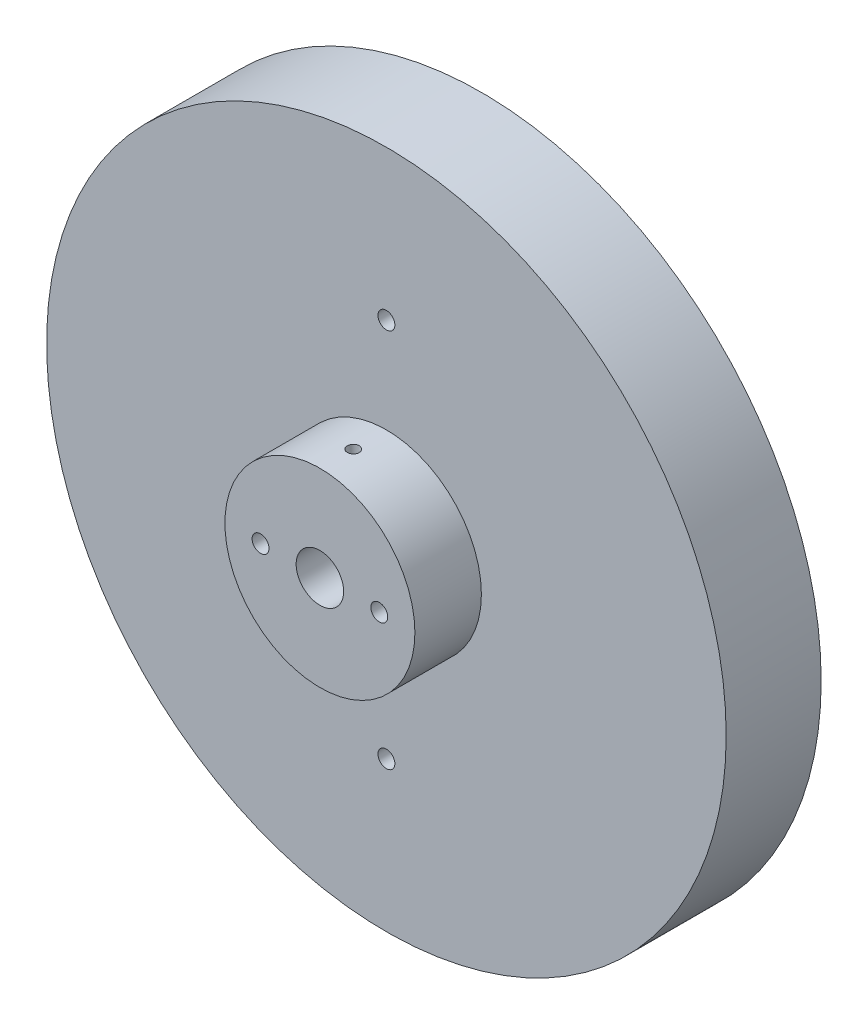
ISO-10303-21;
HEADER;
FILE_DESCRIPTION(('STEP AP214'),'2;1');
FILE_NAME('part.step','',(''),(''),'','','');
FILE_SCHEMA(('AUTOMOTIVE_DESIGN { 1 0 10303 214 1 1 1 1 }'));
ENDSEC;
DATA;
#1=APPLICATION_CONTEXT('core data for automotive mechanical design processes');
#2=APPLICATION_PROTOCOL_DEFINITION('international standard','automotive_design',2000,#1);
#3=PRODUCT_CONTEXT('',#1,'mechanical');
#4=PRODUCT('Part','Part','',(#3));
#5=PRODUCT_RELATED_PRODUCT_CATEGORY('part','',(#4));
#6=PRODUCT_DEFINITION_FORMATION('','',#4);
#7=PRODUCT_DEFINITION_CONTEXT('part definition',#1,'design');
#8=PRODUCT_DEFINITION('design','',#6,#7);
#9=PRODUCT_DEFINITION_SHAPE('','',#8);
#10=(LENGTH_UNIT() NAMED_UNIT(*) SI_UNIT(.MILLI.,.METRE.));
#11=(NAMED_UNIT(*) PLANE_ANGLE_UNIT() SI_UNIT($,.RADIAN.));
#12=(NAMED_UNIT(*) SI_UNIT($,.STERADIAN.) SOLID_ANGLE_UNIT());
#13=UNCERTAINTY_MEASURE_WITH_UNIT(LENGTH_MEASURE(1.E-05),#10,'distance_accuracy_value','');
#14=(GEOMETRIC_REPRESENTATION_CONTEXT(3) GLOBAL_UNCERTAINTY_ASSIGNED_CONTEXT((#13)) GLOBAL_UNIT_ASSIGNED_CONTEXT((#10,
#11,#12)) REPRESENTATION_CONTEXT('',''));
#15=CARTESIAN_POINT('',(0.,0.,0.));
#16=DIRECTION('',(0.,0.,1.));
#17=DIRECTION('',(1.,0.,0.));
#18=AXIS2_PLACEMENT_3D('',#15,#16,#17);
#19=CARTESIAN_POINT('',(0.,0.,12.7));
#20=DIRECTION('',(0.,0.,-1.));
#21=DIRECTION('',(-1.,0.,0.));
#22=AXIS2_PLACEMENT_3D('',#19,#20,#21);
#23=CYLINDRICAL_SURFACE('',#22,45.4279);
#24=CARTESIAN_POINT('',(0.,0.,12.7));
#25=DIRECTION('',(0.,0.,1.));
#26=DIRECTION('',(1.,0.,0.));
#27=AXIS2_PLACEMENT_3D('',#24,#25,#26);
#28=CIRCLE('',#27,45.4279);
#29=CARTESIAN_POINT('',(45.4279,0.,12.7));
#30=VERTEX_POINT('',#29);
#31=EDGE_CURVE('E54',#30,#30,#28,.T.);
#32=ORIENTED_EDGE('',*,*,#31,.F.);
#33=EDGE_LOOP('',(#32));
#34=FACE_BOUND('',#33,.T.);
#35=CARTESIAN_POINT('',(0.,0.,0.));
#36=DIRECTION('',(0.,0.,1.));
#37=DIRECTION('',(1.,0.,0.));
#38=AXIS2_PLACEMENT_3D('',#35,#36,#37);
#39=CIRCLE('',#38,45.4279);
#40=CARTESIAN_POINT('',(45.4279,0.,0.));
#41=VERTEX_POINT('',#40);
#42=EDGE_CURVE('E59',#41,#41,#39,.T.);
#43=ORIENTED_EDGE('',*,*,#42,.T.);
#44=EDGE_LOOP('',(#43));
#45=FACE_BOUND('',#44,.T.);
#46=ADVANCED_FACE('F42',(#34,#45),#23,.T.);
#47=CARTESIAN_POINT('',(0.,0.,12.7));
#48=DIRECTION('',(0.,0.,1.));
#49=DIRECTION('',(1.,0.,0.));
#50=AXIS2_PLACEMENT_3D('',#47,#48,#49);
#51=PLANE('',#50);
#52=CARTESIAN_POINT('',(0.,25.4,12.7));
#53=DIRECTION('',(0.,0.,1.));
#54=DIRECTION('',(1.,0.,0.));
#55=AXIS2_PLACEMENT_3D('',#52,#53,#54);
#56=CIRCLE('',#55,1.1303);
#57=CARTESIAN_POINT('',(1.1303,25.4,12.7));
#58=VERTEX_POINT('',#57);
#59=EDGE_CURVE('E170',#58,#58,#56,.T.);
#60=ORIENTED_EDGE('',*,*,#59,.F.);
#61=EDGE_LOOP('',(#60));
#62=FACE_BOUND('',#61,.T.);
#63=CARTESIAN_POINT('',(0.,-25.4,12.7));
#64=DIRECTION('',(0.,0.,1.));
#65=DIRECTION('',(1.,0.,0.));
#66=AXIS2_PLACEMENT_3D('',#63,#64,#65);
#67=CIRCLE('',#66,1.1303);
#68=CARTESIAN_POINT('',(1.1303,-25.4,12.7));
#69=VERTEX_POINT('',#68);
#70=EDGE_CURVE('E99',#69,#69,#67,.T.);
#71=ORIENTED_EDGE('',*,*,#70,.F.);
#72=EDGE_LOOP('',(#71));
#73=FACE_BOUND('',#72,.T.);
#74=CARTESIAN_POINT('',(0.,0.,12.7));
#75=DIRECTION('',(0.,0.,1.));
#76=DIRECTION('',(1.,0.,0.));
#77=AXIS2_PLACEMENT_3D('',#74,#75,#76);
#78=CIRCLE('',#77,12.7);
#79=CARTESIAN_POINT('',(12.7,0.,12.7));
#80=VERTEX_POINT('',#79);
#81=EDGE_CURVE('E12',#80,#80,#78,.T.);
#82=ORIENTED_EDGE('',*,*,#81,.F.);
#83=EDGE_LOOP('',(#82));
#84=FACE_BOUND('',#83,.T.);
#85=ORIENTED_EDGE('',*,*,#31,.T.);
#86=EDGE_LOOP('',(#85));
#87=FACE_BOUND('',#86,.T.);
#88=ADVANCED_FACE('F112',(#62,#73,#84,#87),#51,.T.);
#89=CARTESIAN_POINT('',(0.,0.,0.));
#90=DIRECTION('',(0.,0.,1.));
#91=DIRECTION('',(1.,0.,0.));
#92=AXIS2_PLACEMENT_3D('',#89,#90,#91);
#93=PLANE('',#92);
#94=CARTESIAN_POINT('',(0.,25.4,0.));
#95=DIRECTION('',(0.,0.,1.));
#96=DIRECTION('',(1.,0.,0.));
#97=AXIS2_PLACEMENT_3D('',#94,#95,#96);
#98=CIRCLE('',#97,1.1303);
#99=CARTESIAN_POINT('',(1.1303,25.4,0.));
#100=VERTEX_POINT('',#99);
#101=EDGE_CURVE('E71',#100,#100,#98,.T.);
#102=ORIENTED_EDGE('',*,*,#101,.T.);
#103=EDGE_LOOP('',(#102));
#104=FACE_BOUND('',#103,.T.);
#105=CARTESIAN_POINT('',(0.,-25.4,0.));
#106=DIRECTION('',(0.,0.,1.));
#107=DIRECTION('',(1.,0.,0.));
#108=AXIS2_PLACEMENT_3D('',#105,#106,#107);
#109=CIRCLE('',#108,1.1303);
#110=CARTESIAN_POINT('',(1.1303,-25.4,0.));
#111=VERTEX_POINT('',#110);
#112=EDGE_CURVE('E171',#111,#111,#109,.T.);
#113=ORIENTED_EDGE('',*,*,#112,.T.);
#114=EDGE_LOOP('',(#113));
#115=FACE_BOUND('',#114,.T.);
#116=CARTESIAN_POINT('',(7.9375,0.,0.));
#117=DIRECTION('',(0.,0.,1.));
#118=DIRECTION('',(1.,0.,0.));
#119=AXIS2_PLACEMENT_3D('',#116,#117,#118);
#120=CIRCLE('',#119,1.1303);
#121=CARTESIAN_POINT('',(9.0678,0.,0.));
#122=VERTEX_POINT('',#121);
#123=EDGE_CURVE('E185',#122,#122,#120,.T.);
#124=ORIENTED_EDGE('',*,*,#123,.T.);
#125=EDGE_LOOP('',(#124));
#126=FACE_BOUND('',#125,.T.);
#127=CARTESIAN_POINT('',(-7.9375,0.,0.));
#128=DIRECTION('',(0.,0.,1.));
#129=DIRECTION('',(1.,0.,0.));
#130=AXIS2_PLACEMENT_3D('',#127,#128,#129);
#131=CIRCLE('',#130,1.1303);
#132=CARTESIAN_POINT('',(-6.8072,0.,0.));
#133=VERTEX_POINT('',#132);
#134=EDGE_CURVE('E189',#133,#133,#131,.T.);
#135=ORIENTED_EDGE('',*,*,#134,.T.);
#136=EDGE_LOOP('',(#135));
#137=FACE_BOUND('',#136,.T.);
#138=CARTESIAN_POINT('',(0.,0.,0.));
#139=DIRECTION('',(0.,0.,1.));
#140=DIRECTION('',(1.,0.,0.));
#141=AXIS2_PLACEMENT_3D('',#138,#139,#140);
#142=CIRCLE('',#141,3.175);
#143=CARTESIAN_POINT('',(3.175,0.,0.));
#144=VERTEX_POINT('',#143);
#145=EDGE_CURVE('E192',#144,#144,#142,.T.);
#146=ORIENTED_EDGE('',*,*,#145,.T.);
#147=EDGE_LOOP('',(#146));
#148=FACE_BOUND('',#147,.T.);
#149=ORIENTED_EDGE('',*,*,#42,.F.);
#150=EDGE_LOOP('',(#149));
#151=FACE_BOUND('',#150,.T.);
#152=ADVANCED_FACE('F110',(#104,#115,#126,#137,#148,#151),#93,.F.);
#153=CARTESIAN_POINT('',(0.,0.,21.59));
#154=DIRECTION('',(0.,0.,-1.));
#155=DIRECTION('',(-1.,0.,0.));
#156=AXIS2_PLACEMENT_3D('',#153,#154,#155);
#157=CYLINDRICAL_SURFACE('',#156,12.7);
#158=CARTESIAN_POINT('',(0.,-12.7,17.93875));
#159=CARTESIAN_POINT('',(0.0445386407758269,-12.6999996702539,17.9387480403016));
#160=CARTESIAN_POINT('',(0.089108467211095,-12.6997632002031,17.9349886967728));
#161=CARTESIAN_POINT('',(0.177017446128859,-12.6988426082153,17.9200458893796));
#162=CARTESIAN_POINT('',(0.22035510492359,-12.6981579652653,17.9088537845104));
#163=CARTESIAN_POINT('',(0.30451365793703,-12.6964184789674,17.8793681727514));
#164=CARTESIAN_POINT('',(0.345335866612445,-12.6953638309289,17.8610784118634));
#165=CARTESIAN_POINT('',(0.423320136899089,-12.6930029528423,17.8179227393988));
#166=CARTESIAN_POINT('',(0.460483034079384,-12.6916967804297,17.793058333881));
#167=CARTESIAN_POINT('',(0.530160094540578,-12.6889774856253,17.7374183667785));
#168=CARTESIAN_POINT('',(0.562668055066121,-12.687564224299,17.70663504373));
#169=CARTESIAN_POINT('',(0.622059418478501,-12.6847912204754,17.6400470576777));
#170=CARTESIAN_POINT('',(0.648942586333779,-12.6834314802164,17.604242184953));
#171=CARTESIAN_POINT('',(0.696340354075598,-12.6809177882767,17.5285923548368));
#172=CARTESIAN_POINT('',(0.716849801975732,-12.6797640033921,17.4887441634927));
#173=CARTESIAN_POINT('',(0.750884974290381,-12.6777941327705,17.4061615122453));
#174=CARTESIAN_POINT('',(0.764410773811094,-12.6769780434017,17.363427083388));
#175=CARTESIAN_POINT('',(0.784077488480055,-12.6757769173313,17.2763447780049));
#176=CARTESIAN_POINT('',(0.790228118980676,-12.6753913135949,17.2319991035465));
#177=CARTESIAN_POINT('',(0.794999892705035,-12.6750929451796,17.1429031989418));
#178=CARTESIAN_POINT('',(0.793621121204831,-12.6751801751455,17.098152973383));
#179=CARTESIAN_POINT('',(0.783381292050813,-12.6758171107668,17.0095844621497));
#180=CARTESIAN_POINT('',(0.774530748068544,-12.6763661665743,16.9657649556167));
#181=CARTESIAN_POINT('',(0.74961491575806,-12.6778638552243,16.8802347679882));
#182=CARTESIAN_POINT('',(0.733549584200964,-12.6788124904609,16.8385240995298));
#183=CARTESIAN_POINT('',(0.694648277426073,-12.6810031805086,16.7583618268452));
#184=CARTESIAN_POINT('',(0.671807532930021,-12.6822454418804,16.7199125429373));
#185=CARTESIAN_POINT('',(0.620007222037515,-12.684883182398,16.6473898419963));
#186=CARTESIAN_POINT('',(0.591047586851629,-12.6862786632663,16.6133164741648));
#187=CARTESIAN_POINT('',(0.527772337502699,-12.689068466804,16.5504516524606));
#188=CARTESIAN_POINT('',(0.493447624305519,-12.6904627833841,16.5216693559599));
#189=CARTESIAN_POINT('',(0.420448470611413,-12.6930908277368,16.4702743364418));
#190=CARTESIAN_POINT('',(0.381774028594806,-12.6943245554532,16.4476616155798));
#191=CARTESIAN_POINT('',(0.301167689969685,-12.6964924973487,16.4092484154907));
#192=CARTESIAN_POINT('',(0.259235627644201,-12.697426696278,16.3934482830919));
#193=CARTESIAN_POINT('',(0.173306827876283,-12.6988901040857,16.3691148854242));
#194=CARTESIAN_POINT('',(0.129310114552844,-12.6994193176937,16.3605815352879));
#195=CARTESIAN_POINT('',(0.0405803715148961,-12.7000125111858,16.3510352798159));
#196=CARTESIAN_POINT('',(-0.00415129103573031,-12.7000772743004,16.3500097135973));
#197=CARTESIAN_POINT('',(-0.0931510123009727,-12.6997363522161,16.35547505714));
#198=CARTESIAN_POINT('',(-0.137419073426951,-12.6993306694653,16.361965927786));
#199=CARTESIAN_POINT('',(-0.224199315938051,-12.6980950296066,16.3822694097697));
#200=CARTESIAN_POINT('',(-0.266712861570951,-12.6972654091209,16.3960762123074));
#201=CARTESIAN_POINT('',(-0.348819375772882,-12.6952752291308,16.4306137334692));
#202=CARTESIAN_POINT('',(-0.388412318069719,-12.6941146666498,16.4513445143686));
#203=CARTESIAN_POINT('',(-0.463611704701287,-12.6915910567067,16.4991737507236));
#204=CARTESIAN_POINT('',(-0.4992127617111,-12.6902277412494,16.526280662036));
#205=CARTESIAN_POINT('',(-0.565363560986746,-12.6874529497527,16.586080385164));
#206=CARTESIAN_POINT('',(-0.595913253511985,-12.6860414732392,16.6187732519779));
#207=CARTESIAN_POINT('',(-0.651137017260602,-12.6833271753912,16.6888714783301));
#208=CARTESIAN_POINT('',(-0.675802874633838,-12.6820245075826,16.7262833155391));
#209=CARTESIAN_POINT('',(-0.718502608340733,-12.6796771747264,16.8047249386905));
#210=CARTESIAN_POINT('',(-0.736536525571194,-12.678632508088,16.8457547023205));
#211=CARTESIAN_POINT('',(-0.765446239525355,-12.6769200942769,16.9302374918798));
#212=CARTESIAN_POINT('',(-0.776327206094562,-12.6762520749295,16.9736887429676));
#213=CARTESIAN_POINT('',(-0.790639032484721,-12.6753675342878,17.0618057420555));
#214=CARTESIAN_POINT('',(-0.794069966247641,-12.6751510085123,17.1064714779973));
#215=CARTESIAN_POINT('',(-0.793383621065992,-12.6751939814164,17.1956678736759));
#216=CARTESIAN_POINT('',(-0.789279255715115,-12.6754526657069,17.2401986337477));
#217=CARTESIAN_POINT('',(-0.773665593152845,-12.6764151826815,17.3279373930398));
#218=CARTESIAN_POINT('',(-0.762156282524843,-12.6771190161721,17.3711453898633));
#219=CARTESIAN_POINT('',(-0.732062340106625,-12.6788923166027,17.4550140619613));
#220=CARTESIAN_POINT('',(-0.713477759125769,-12.6799617809168,17.4956747555262));
#221=CARTESIAN_POINT('',(-0.669762608051094,-12.6823458051446,17.573300428041));
#222=CARTESIAN_POINT('',(-0.644632207515187,-12.6836603587093,17.6102655026851));
#223=CARTESIAN_POINT('',(-0.588491059979675,-12.6863890500341,17.6795161047235));
#224=CARTESIAN_POINT('',(-0.557470981393586,-12.6878033435559,17.7117940606626));
#225=CARTESIAN_POINT('',(-0.490443479553575,-12.6905708218905,17.7706955755633));
#226=CARTESIAN_POINT('',(-0.454434837916005,-12.6919239916675,17.7973177491462));
#227=CARTESIAN_POINT('',(-0.378411362862406,-12.694418147476,17.8441716000475));
#228=CARTESIAN_POINT('',(-0.338391628002222,-12.6955588689172,17.8643953301282));
#229=CARTESIAN_POINT('',(-0.25554662803241,-12.6974960352311,17.8978117224983));
#230=CARTESIAN_POINT('',(-0.212724715084374,-12.6982928831025,17.9110126193615));
#231=CARTESIAN_POINT('',(-0.141367357780981,-12.699243700178,17.9265776249612));
#232=CARTESIAN_POINT('',(-0.11329315964628,-12.6995260521692,17.9311363630951));
#233=CARTESIAN_POINT('',(-0.0568168717581131,-12.6999043071371,17.9372231736441));
#234=CARTESIAN_POINT('',(-0.0284147824580345,-12.7000002103716,17.9387512502493));
#235=CARTESIAN_POINT('',(0.,-12.7,17.93875));
#236=B_SPLINE_CURVE_WITH_KNOTS('',3,(#158,#159,#160,#161,#162,#163,#164,#165,#166,#167,#168,
#169,#170,#171,#172,#173,#174,#175,#176,#177,#178,#179,#180,#181,#182,#183,#184,#185,#186,#187,
#188,#189,#190,#191,#192,#193,#194,#195,#196,#197,#198,#199,#200,#201,#202,#203,#204,#205,#206,
#207,#208,#209,#210,#211,#212,#213,#214,#215,#216,#217,#218,#219,#220,#221,#222,#223,#224,#225,
#226,#227,#228,#229,#230,#231,#232,#233,#234,#235),.UNSPECIFIED.,.T.,.F.,(4,2,2,2,2,2,2,2,2,2,2,
2,2,2,2,2,2,2,2,2,2,2,2,2,2,2,2,2,2,2,2,2,2,2,2,2,2,2,4),(0.,0.133512191491095,
0.267179870793084,0.400777098686803,0.534343749833107,0.668086756061141,0.801835349615526,
0.935691774914923,1.06954676061482,1.20322522398051,1.33690217334166,1.47039133627064,
1.60388129903803,1.73746545055381,1.87105110392134,2.00486582382561,2.13868059048139,
2.27250216883244,2.40632218428552,2.53991647791457,2.67351007632484,2.80699776092145,
2.94048664615583,3.07415356898776,3.20782180795444,3.34167557019411,3.47552850699167,
3.60928459395978,3.74303935338564,3.87656510497391,4.01009109849078,4.14361613314081,
4.27713770940417,4.41087262934118,4.54464026985125,4.67857341112892,4.81234916196738,
4.8975274488601,4.98270561798765),.UNSPECIFIED.);
#237=CARTESIAN_POINT('',(0.,-12.7,17.93875));
#238=VERTEX_POINT('',#237);
#239=EDGE_CURVE('E98',#238,#238,#236,.T.);
#240=ORIENTED_EDGE('',*,*,#239,.T.);
#241=EDGE_LOOP('',(#240));
#242=FACE_BOUND('',#241,.T.);
#243=CARTESIAN_POINT('',(0.,12.7,17.93875));
#244=CARTESIAN_POINT('',(-0.0445386407758269,12.6999996702539,17.9387480403016));
#245=CARTESIAN_POINT('',(-0.089108467211095,12.6997632002031,17.9349886967728));
#246=CARTESIAN_POINT('',(-0.177017446128859,12.6988426082153,17.9200458893796));
#247=CARTESIAN_POINT('',(-0.22035510492359,12.6981579652653,17.9088537845104));
#248=CARTESIAN_POINT('',(-0.30451365793703,12.6964184789674,17.8793681727514));
#249=CARTESIAN_POINT('',(-0.345335866612445,12.6953638309289,17.8610784118634));
#250=CARTESIAN_POINT('',(-0.423320136899089,12.6930029528423,17.8179227393988));
#251=CARTESIAN_POINT('',(-0.460483034079384,12.6916967804297,17.793058333881));
#252=CARTESIAN_POINT('',(-0.530160094540578,12.6889774856253,17.7374183667785));
#253=CARTESIAN_POINT('',(-0.562668055066121,12.687564224299,17.70663504373));
#254=CARTESIAN_POINT('',(-0.622059418478501,12.6847912204754,17.6400470576777));
#255=CARTESIAN_POINT('',(-0.648942586333779,12.6834314802164,17.604242184953));
#256=CARTESIAN_POINT('',(-0.696340354075598,12.6809177882767,17.5285923548368));
#257=CARTESIAN_POINT('',(-0.716849801975732,12.6797640033921,17.4887441634927));
#258=CARTESIAN_POINT('',(-0.750884974290381,12.6777941327705,17.4061615122453));
#259=CARTESIAN_POINT('',(-0.764410773811094,12.6769780434017,17.363427083388));
#260=CARTESIAN_POINT('',(-0.784077488480055,12.6757769173313,17.2763447780049));
#261=CARTESIAN_POINT('',(-0.790228118980676,12.6753913135949,17.2319991035465));
#262=CARTESIAN_POINT('',(-0.794999892705035,12.6750929451796,17.1429031989418));
#263=CARTESIAN_POINT('',(-0.793621121204831,12.6751801751455,17.098152973383));
#264=CARTESIAN_POINT('',(-0.783381292050813,12.6758171107668,17.0095844621497));
#265=CARTESIAN_POINT('',(-0.774530748068544,12.6763661665743,16.9657649556167));
#266=CARTESIAN_POINT('',(-0.74961491575806,12.6778638552243,16.8802347679882));
#267=CARTESIAN_POINT('',(-0.733549584200964,12.6788124904609,16.8385240995298));
#268=CARTESIAN_POINT('',(-0.694648277426073,12.6810031805086,16.7583618268452));
#269=CARTESIAN_POINT('',(-0.671807532930021,12.6822454418804,16.7199125429373));
#270=CARTESIAN_POINT('',(-0.620007222037515,12.684883182398,16.6473898419963));
#271=CARTESIAN_POINT('',(-0.591047586851629,12.6862786632663,16.6133164741648));
#272=CARTESIAN_POINT('',(-0.527772337502699,12.689068466804,16.5504516524606));
#273=CARTESIAN_POINT('',(-0.493447624305519,12.6904627833841,16.5216693559599));
#274=CARTESIAN_POINT('',(-0.420448470611413,12.6930908277368,16.4702743364418));
#275=CARTESIAN_POINT('',(-0.381774028594806,12.6943245554532,16.4476616155798));
#276=CARTESIAN_POINT('',(-0.301167689969685,12.6964924973487,16.4092484154907));
#277=CARTESIAN_POINT('',(-0.259235627644201,12.697426696278,16.3934482830919));
#278=CARTESIAN_POINT('',(-0.173306827876283,12.6988901040857,16.3691148854242));
#279=CARTESIAN_POINT('',(-0.129310114552844,12.6994193176937,16.3605815352879));
#280=CARTESIAN_POINT('',(-0.0405803715148961,12.7000125111858,16.3510352798159));
#281=CARTESIAN_POINT('',(0.00415129103573031,12.7000772743004,16.3500097135973));
#282=CARTESIAN_POINT('',(0.0931510123009727,12.6997363522161,16.35547505714));
#283=CARTESIAN_POINT('',(0.137419073426951,12.6993306694653,16.361965927786));
#284=CARTESIAN_POINT('',(0.224199315938051,12.6980950296066,16.3822694097697));
#285=CARTESIAN_POINT('',(0.266712861570951,12.6972654091209,16.3960762123074));
#286=CARTESIAN_POINT('',(0.348819375772882,12.6952752291308,16.4306137334692));
#287=CARTESIAN_POINT('',(0.388412318069719,12.6941146666498,16.4513445143686));
#288=CARTESIAN_POINT('',(0.463611704701287,12.6915910567067,16.4991737507236));
#289=CARTESIAN_POINT('',(0.4992127617111,12.6902277412494,16.526280662036));
#290=CARTESIAN_POINT('',(0.565363560986746,12.6874529497527,16.586080385164));
#291=CARTESIAN_POINT('',(0.595913253511985,12.6860414732392,16.6187732519779));
#292=CARTESIAN_POINT('',(0.651137017260602,12.6833271753912,16.6888714783301));
#293=CARTESIAN_POINT('',(0.675802874633838,12.6820245075826,16.7262833155391));
#294=CARTESIAN_POINT('',(0.718502608340733,12.6796771747264,16.8047249386905));
#295=CARTESIAN_POINT('',(0.736536525571194,12.678632508088,16.8457547023205));
#296=CARTESIAN_POINT('',(0.765446239525355,12.6769200942769,16.9302374918798));
#297=CARTESIAN_POINT('',(0.776327206094562,12.6762520749295,16.9736887429676));
#298=CARTESIAN_POINT('',(0.790639032484721,12.6753675342878,17.0618057420555));
#299=CARTESIAN_POINT('',(0.794069966247641,12.6751510085123,17.1064714779973));
#300=CARTESIAN_POINT('',(0.793383621065992,12.6751939814164,17.1956678736759));
#301=CARTESIAN_POINT('',(0.789279255715115,12.6754526657069,17.2401986337477));
#302=CARTESIAN_POINT('',(0.773665593152845,12.6764151826815,17.3279373930398));
#303=CARTESIAN_POINT('',(0.762156282524843,12.6771190161721,17.3711453898633));
#304=CARTESIAN_POINT('',(0.732062340106625,12.6788923166027,17.4550140619613));
#305=CARTESIAN_POINT('',(0.713477759125769,12.6799617809168,17.4956747555262));
#306=CARTESIAN_POINT('',(0.669762608051094,12.6823458051446,17.573300428041));
#307=CARTESIAN_POINT('',(0.644632207515187,12.6836603587093,17.6102655026851));
#308=CARTESIAN_POINT('',(0.588491059979675,12.6863890500341,17.6795161047235));
#309=CARTESIAN_POINT('',(0.557470981393586,12.6878033435559,17.7117940606626));
#310=CARTESIAN_POINT('',(0.490443479553575,12.6905708218905,17.7706955755633));
#311=CARTESIAN_POINT('',(0.454434837916005,12.6919239916675,17.7973177491462));
#312=CARTESIAN_POINT('',(0.378411362862406,12.694418147476,17.8441716000475));
#313=CARTESIAN_POINT('',(0.338391628002222,12.6955588689172,17.8643953301282));
#314=CARTESIAN_POINT('',(0.25554662803241,12.6974960352311,17.8978117224983));
#315=CARTESIAN_POINT('',(0.212724715084374,12.6982928831025,17.9110126193615));
#316=CARTESIAN_POINT('',(0.141367357780981,12.699243700178,17.9265776249612));
#317=CARTESIAN_POINT('',(0.11329315964628,12.6995260521692,17.9311363630951));
#318=CARTESIAN_POINT('',(0.0568168717581131,12.6999043071371,17.9372231736441));
#319=CARTESIAN_POINT('',(0.0284147824580345,12.7000002103716,17.9387512502493));
#320=CARTESIAN_POINT('',(0.,12.7,17.93875));
#321=B_SPLINE_CURVE_WITH_KNOTS('',3,(#243,#244,#245,#246,#247,#248,#249,#250,#251,#252,#253,
#254,#255,#256,#257,#258,#259,#260,#261,#262,#263,#264,#265,#266,#267,#268,#269,#270,#271,#272,
#273,#274,#275,#276,#277,#278,#279,#280,#281,#282,#283,#284,#285,#286,#287,#288,#289,#290,#291,
#292,#293,#294,#295,#296,#297,#298,#299,#300,#301,#302,#303,#304,#305,#306,#307,#308,#309,#310,
#311,#312,#313,#314,#315,#316,#317,#318,#319,#320),.UNSPECIFIED.,.T.,.F.,(4,2,2,2,2,2,2,2,2,2,2,
2,2,2,2,2,2,2,2,2,2,2,2,2,2,2,2,2,2,2,2,2,2,2,2,2,2,2,4),(0.,0.133512191491095,
0.267179870793084,0.400777098686803,0.534343749833107,0.668086756061141,0.801835349615526,
0.935691774914923,1.06954676061482,1.20322522398051,1.33690217334166,1.47039133627064,
1.60388129903803,1.73746545055381,1.87105110392134,2.00486582382561,2.13868059048139,
2.27250216883244,2.40632218428552,2.53991647791457,2.67351007632484,2.80699776092145,
2.94048664615583,3.07415356898776,3.20782180795444,3.34167557019411,3.47552850699167,
3.60928459395978,3.74303935338564,3.87656510497391,4.01009109849078,4.14361613314081,
4.27713770940417,4.41087262934118,4.54464026985125,4.67857341112892,4.81234916196738,
4.8975274488601,4.98270561798765),.UNSPECIFIED.);
#322=CARTESIAN_POINT('',(0.,12.7,17.93875));
#323=VERTEX_POINT('',#322);
#324=EDGE_CURVE('E91',#323,#323,#321,.T.);
#325=ORIENTED_EDGE('',*,*,#324,.T.);
#326=EDGE_LOOP('',(#325));
#327=FACE_BOUND('',#326,.T.);
#328=CARTESIAN_POINT('',(0.,0.,21.59));
#329=DIRECTION('',(0.,0.,1.));
#330=DIRECTION('',(1.,0.,0.));
#331=AXIS2_PLACEMENT_3D('',#328,#329,#330);
#332=CIRCLE('',#331,12.7);
#333=CARTESIAN_POINT('',(12.7,0.,21.59));
#334=VERTEX_POINT('',#333);
#335=EDGE_CURVE('E62',#334,#334,#332,.T.);
#336=ORIENTED_EDGE('',*,*,#335,.F.);
#337=EDGE_LOOP('',(#336));
#338=FACE_BOUND('',#337,.T.);
#339=ORIENTED_EDGE('',*,*,#81,.T.);
#340=EDGE_LOOP('',(#339));
#341=FACE_BOUND('',#340,.T.);
#342=ADVANCED_FACE('F105',(#242,#327,#338,#341),#157,.T.);
#343=CARTESIAN_POINT('',(0.,0.,21.59));
#344=DIRECTION('',(0.,0.,1.));
#345=DIRECTION('',(1.,0.,0.));
#346=AXIS2_PLACEMENT_3D('',#343,#344,#345);
#347=PLANE('',#346);
#348=CARTESIAN_POINT('',(7.9375,0.,21.59));
#349=DIRECTION('',(0.,0.,1.));
#350=DIRECTION('',(1.,0.,0.));
#351=AXIS2_PLACEMENT_3D('',#348,#349,#350);
#352=CIRCLE('',#351,1.1303);
#353=CARTESIAN_POINT('',(9.0678,0.,21.59));
#354=VERTEX_POINT('',#353);
#355=EDGE_CURVE('E199',#354,#354,#352,.T.);
#356=ORIENTED_EDGE('',*,*,#355,.F.);
#357=EDGE_LOOP('',(#356));
#358=FACE_BOUND('',#357,.T.);
#359=CARTESIAN_POINT('',(-7.9375,0.,21.59));
#360=DIRECTION('',(0.,0.,1.));
#361=DIRECTION('',(1.,0.,0.));
#362=AXIS2_PLACEMENT_3D('',#359,#360,#361);
#363=CIRCLE('',#362,1.1303);
#364=CARTESIAN_POINT('',(-6.8072,0.,21.59));
#365=VERTEX_POINT('',#364);
#366=EDGE_CURVE('E203',#365,#365,#363,.T.);
#367=ORIENTED_EDGE('',*,*,#366,.F.);
#368=EDGE_LOOP('',(#367));
#369=FACE_BOUND('',#368,.T.);
#370=CARTESIAN_POINT('',(0.,0.,21.59));
#371=DIRECTION('',(0.,0.,1.));
#372=DIRECTION('',(1.,0.,0.));
#373=AXIS2_PLACEMENT_3D('',#370,#371,#372);
#374=CIRCLE('',#373,3.175);
#375=CARTESIAN_POINT('',(3.175,0.,21.59));
#376=VERTEX_POINT('',#375);
#377=EDGE_CURVE('E194',#376,#376,#374,.T.);
#378=ORIENTED_EDGE('',*,*,#377,.F.);
#379=EDGE_LOOP('',(#378));
#380=FACE_BOUND('',#379,.T.);
#381=ORIENTED_EDGE('',*,*,#335,.T.);
#382=EDGE_LOOP('',(#381));
#383=FACE_BOUND('',#382,.T.);
#384=ADVANCED_FACE('F109',(#358,#369,#380,#383),#347,.T.);
#385=CARTESIAN_POINT('',(0.,0.,0.));
#386=DIRECTION('',(0.,0.,1.));
#387=DIRECTION('',(1.,0.,0.));
#388=AXIS2_PLACEMENT_3D('',#385,#386,#387);
#389=CYLINDRICAL_SURFACE('',#388,3.175);
#390=CARTESIAN_POINT('',(0.,-3.175,17.93875));
#391=CARTESIAN_POINT('',(-0.0438552635877327,-3.17499925846823,17.9387487692969));
#392=CARTESIAN_POINT('',(-0.0877242751854455,-3.17408230928092,17.9351032210489));
#393=CARTESIAN_POINT('',(-0.17420501299524,-3.17051326901651,17.9206391907667));
#394=CARTESIAN_POINT('',(-0.216816012302433,-3.167860194514,17.9098166432862));
#395=CARTESIAN_POINT('',(-0.299519378196613,-3.16111268934038,17.8813675617096));
#396=CARTESIAN_POINT('',(-0.339614702315042,-3.15701999003938,17.8637491981798));
#397=CARTESIAN_POINT('',(-0.416280669799425,-3.14782911098185,17.8222373477679));
#398=CARTESIAN_POINT('',(-0.452851194217885,-3.14273089731102,17.7983436492204));
#399=CARTESIAN_POINT('',(-0.522182686530071,-3.13196506358995,17.7444395821413));
#400=CARTESIAN_POINT('',(-0.554860719323984,-3.12628865866099,17.7143242915841));
#401=CARTESIAN_POINT('',(-0.614758807311748,-3.11506457312193,17.649056541569));
#402=CARTESIAN_POINT('',(-0.641978246218917,-3.10951690710918,17.6139035141075));
#403=CARTESIAN_POINT('',(-0.690576545564488,-3.0990898547443,17.5389141925181));
#404=CARTESIAN_POINT('',(-0.711862630927167,-3.09422162074029,17.4990160820295));
#405=CARTESIAN_POINT('',(-0.747393364107986,-3.08583274338135,17.4160664654975));
#406=CARTESIAN_POINT('',(-0.761639137669979,-3.08231188460184,17.3730154648651));
#407=CARTESIAN_POINT('',(-0.782401934475603,-3.07710668929704,17.2858940655345));
#408=CARTESIAN_POINT('',(-0.789068075326391,-3.07538697360746,17.241861367507));
#409=CARTESIAN_POINT('',(-0.794946855973405,-3.07387287676221,17.1532716322301));
#410=CARTESIAN_POINT('',(-0.794160708378679,-3.07407818237407,17.1087146814636));
#411=CARTESIAN_POINT('',(-0.785276202621618,-3.07635912908627,17.0214841350685));
#412=CARTESIAN_POINT('',(-0.777355538350815,-3.07838931671828,16.9787910669747));
#413=CARTESIAN_POINT('',(-0.754710298902892,-3.08401883870473,16.8953597772261));
#414=CARTESIAN_POINT('',(-0.739985239011735,-3.08761828484494,16.8546216950638));
#415=CARTESIAN_POINT('',(-0.70399776540841,-3.09602247774299,16.7757802997333));
#416=CARTESIAN_POINT('',(-0.682670861410748,-3.10083902452569,16.7377077340947));
#417=CARTESIAN_POINT('',(-0.634130196057913,-3.11112805322879,16.665618016087));
#418=CARTESIAN_POINT('',(-0.606915404578012,-3.11660064985464,16.6316015749811));
#419=CARTESIAN_POINT('',(-0.546451062227145,-3.12777653452301,16.5675714200284));
#420=CARTESIAN_POINT('',(-0.513051561612767,-3.1334819509876,16.5376994990092));
#421=CARTESIAN_POINT('',(-0.441648806345706,-3.14433990118774,16.4839537591962));
#422=CARTESIAN_POINT('',(-0.403645411120451,-3.14949241803232,16.4600801236189));
#423=CARTESIAN_POINT('',(-0.323911324427234,-3.15868966566505,16.4189565647896));
#424=CARTESIAN_POINT('',(-0.282168278906227,-3.16273053067588,16.4017296741154));
#425=CARTESIAN_POINT('',(-0.196255220975607,-3.16922106074626,16.3745770923954));
#426=CARTESIAN_POINT('',(-0.152085674550463,-3.17167103017036,16.3646500047287));
#427=CARTESIAN_POINT('',(-0.0637857343313883,-3.17465868364436,16.3525953715584));
#428=CARTESIAN_POINT('',(-0.0196832643270934,-3.17524369981464,16.3502747320352));
#429=CARTESIAN_POINT('',(0.0682798962491322,-3.17457034214314,16.3529692635877));
#430=CARTESIAN_POINT('',(0.112140608228599,-3.1733121342381,16.3579837743145));
#431=CARTESIAN_POINT('',(0.197704217227561,-3.1691240334656,16.3750471056904));
#432=CARTESIAN_POINT('',(0.239429458787633,-3.16621918923325,16.3869905852566));
#433=CARTESIAN_POINT('',(0.320281983922788,-3.15906523927229,16.4174524986317));
#434=CARTESIAN_POINT('',(0.359409004654769,-3.15481599779068,16.4359715964491));
#435=CARTESIAN_POINT('',(0.434722658635794,-3.14533125444339,16.4794332848629));
#436=CARTESIAN_POINT('',(0.470844796304794,-3.14007958981668,16.5044840261433));
#437=CARTESIAN_POINT('',(0.538441166386219,-3.12919802778343,16.5601596600717));
#438=CARTESIAN_POINT('',(0.56991459495655,-3.12356806520694,16.590785514714));
#439=CARTESIAN_POINT('',(0.62811584227182,-3.11239406391741,16.6576385376135));
#440=CARTESIAN_POINT('',(0.654708213283326,-3.10685552632436,16.6939847428388));
#441=CARTESIAN_POINT('',(0.701416109977552,-3.09664564807955,16.7707376857381));
#442=CARTESIAN_POINT('',(0.721531923158574,-3.09197426893801,16.8111442430662));
#443=CARTESIAN_POINT('',(0.754565960072416,-3.0840790846376,16.8946542781103));
#444=CARTESIAN_POINT('',(0.767526826562776,-3.08084672591967,16.9377400366654));
#445=CARTESIAN_POINT('',(0.785995411725541,-3.07618735414389,17.025572183383));
#446=CARTESIAN_POINT('',(0.791504760374122,-3.074759946268,17.0703182061714));
#447=CARTESIAN_POINT('',(0.794828754051738,-3.0739021855376,17.1588223751234));
#448=CARTESIAN_POINT('',(0.792859887575312,-3.07441564402039,17.2025719760868));
#449=CARTESIAN_POINT('',(0.781778809773891,-3.07725185183317,17.2890941410868));
#450=CARTESIAN_POINT('',(0.77266674200508,-3.07957456480274,17.3318667247406));
#451=CARTESIAN_POINT('',(0.747676156538477,-3.08573625444607,17.4149853095888));
#452=CARTESIAN_POINT('',(0.73183824331003,-3.08956612229214,17.4553442406896));
#453=CARTESIAN_POINT('',(0.693877683449348,-3.09831187404388,17.5328608483527));
#454=CARTESIAN_POINT('',(0.671754165143089,-3.10322790855576,17.5700180799781));
#455=CARTESIAN_POINT('',(0.621171683653815,-3.11375231464442,17.6411226578469));
#456=CARTESIAN_POINT('',(0.592562507041065,-3.11937540140138,17.6749609846868));
#457=CARTESIAN_POINT('',(0.530113542254565,-3.1305924775116,17.7374269778709));
#458=CARTESIAN_POINT('',(0.496272513750686,-3.13618645963902,17.7660534051014));
#459=CARTESIAN_POINT('',(0.423580764630117,-3.14683592780222,17.8177884841154));
#460=CARTESIAN_POINT('',(0.384650415142419,-3.15187982656105,17.8407878164012));
#461=CARTESIAN_POINT('',(0.303353289824291,-3.16073856132667,17.879878865806));
#462=CARTESIAN_POINT('',(0.260989002318606,-3.16455427751551,17.8959755325099));
#463=CARTESIAN_POINT('',(0.182250425674669,-3.16996264853432,17.9184150935494));
#464=CARTESIAN_POINT('',(0.146251173772185,-3.17183867923715,17.9260241994491));
#465=CARTESIAN_POINT('',(0.0735044628546159,-3.17435761935239,17.9361919784999));
#466=CARTESIAN_POINT('',(0.0367570603242175,-3.17500062151098,17.9387510315074));
#467=CARTESIAN_POINT('',(0.,-3.175,17.93875));
#468=B_SPLINE_CURVE_WITH_KNOTS('',3,(#390,#391,#392,#393,#394,#395,#396,#397,#398,#399,#400,
#401,#402,#403,#404,#405,#406,#407,#408,#409,#410,#411,#412,#413,#414,#415,#416,#417,#418,#419,
#420,#421,#422,#423,#424,#425,#426,#427,#428,#429,#430,#431,#432,#433,#434,#435,#436,#437,#438,
#439,#440,#441,#442,#443,#444,#445,#446,#447,#448,#449,#450,#451,#452,#453,#454,#455,#456,#457,
#458,#459,#460,#461,#462,#463,#464,#465,#466,#467),.UNSPECIFIED.,.T.,.F.,(4,2,2,2,2,2,2,2,2,2,2,
2,2,2,2,2,2,2,2,2,2,2,2,2,2,2,2,2,2,2,2,2,2,2,2,2,2,2,4),(0.,0.131431089516375,
0.262936692483397,0.39428467745973,0.525637093339603,0.659418054188196,0.793214110694495,
0.928997843263226,1.06475985702124,1.19780206156782,1.33082261834636,1.46061904666214,
1.59042472250778,1.72154070999928,1.85267965567469,1.98755794262773,2.12244034891239,
2.25778604517323,2.39310583993573,2.52496271818992,2.6568077267216,2.78669895263678,
2.91660329874712,3.04881273419999,3.18104500425076,3.31652302787369,3.45199503671614,
3.58665068066594,3.72127686471066,3.85203583794266,3.98279218339235,4.11277011962707,
4.24276608972444,4.37615317516911,4.50957193170179,4.64540698160198,4.78114446688797,
4.89131103556887,5.00146931739441),.UNSPECIFIED.);
#469=CARTESIAN_POINT('',(0.,-3.175,17.93875));
#470=VERTEX_POINT('',#469);
#471=EDGE_CURVE('E45',#470,#470,#468,.T.);
#472=ORIENTED_EDGE('',*,*,#471,.T.);
#473=EDGE_LOOP('',(#472));
#474=FACE_BOUND('',#473,.T.);
#475=CARTESIAN_POINT('',(0.,3.175,17.93875));
#476=CARTESIAN_POINT('',(0.0438552635877327,3.17499925846823,17.9387487692969));
#477=CARTESIAN_POINT('',(0.0877242751854455,3.17408230928092,17.9351032210489));
#478=CARTESIAN_POINT('',(0.17420501299524,3.17051326901651,17.9206391907667));
#479=CARTESIAN_POINT('',(0.216816012302433,3.167860194514,17.9098166432862));
#480=CARTESIAN_POINT('',(0.299519378196613,3.16111268934038,17.8813675617096));
#481=CARTESIAN_POINT('',(0.339614702315042,3.15701999003938,17.8637491981798));
#482=CARTESIAN_POINT('',(0.416280669799425,3.14782911098185,17.8222373477679));
#483=CARTESIAN_POINT('',(0.452851194217885,3.14273089731102,17.7983436492204));
#484=CARTESIAN_POINT('',(0.522182686530071,3.13196506358995,17.7444395821413));
#485=CARTESIAN_POINT('',(0.554860719323984,3.12628865866099,17.7143242915841));
#486=CARTESIAN_POINT('',(0.614758807311748,3.11506457312193,17.649056541569));
#487=CARTESIAN_POINT('',(0.641978246218917,3.10951690710918,17.6139035141075));
#488=CARTESIAN_POINT('',(0.690576545564488,3.0990898547443,17.5389141925181));
#489=CARTESIAN_POINT('',(0.711862630927167,3.09422162074029,17.4990160820295));
#490=CARTESIAN_POINT('',(0.747393364107986,3.08583274338135,17.4160664654975));
#491=CARTESIAN_POINT('',(0.761639137669979,3.08231188460184,17.3730154648651));
#492=CARTESIAN_POINT('',(0.782401934475603,3.07710668929704,17.2858940655345));
#493=CARTESIAN_POINT('',(0.789068075326391,3.07538697360746,17.241861367507));
#494=CARTESIAN_POINT('',(0.794946855973405,3.07387287676221,17.1532716322301));
#495=CARTESIAN_POINT('',(0.794160708378679,3.07407818237407,17.1087146814636));
#496=CARTESIAN_POINT('',(0.785276202621618,3.07635912908627,17.0214841350685));
#497=CARTESIAN_POINT('',(0.777355538350815,3.07838931671828,16.9787910669747));
#498=CARTESIAN_POINT('',(0.754710298902892,3.08401883870473,16.8953597772261));
#499=CARTESIAN_POINT('',(0.739985239011735,3.08761828484494,16.8546216950638));
#500=CARTESIAN_POINT('',(0.70399776540841,3.09602247774299,16.7757802997333));
#501=CARTESIAN_POINT('',(0.682670861410748,3.10083902452569,16.7377077340947));
#502=CARTESIAN_POINT('',(0.634130196057913,3.11112805322879,16.665618016087));
#503=CARTESIAN_POINT('',(0.606915404578012,3.11660064985464,16.6316015749811));
#504=CARTESIAN_POINT('',(0.546451062227145,3.12777653452301,16.5675714200284));
#505=CARTESIAN_POINT('',(0.513051561612767,3.1334819509876,16.5376994990092));
#506=CARTESIAN_POINT('',(0.441648806345706,3.14433990118774,16.4839537591962));
#507=CARTESIAN_POINT('',(0.403645411120451,3.14949241803232,16.4600801236189));
#508=CARTESIAN_POINT('',(0.323911324427234,3.15868966566505,16.4189565647896));
#509=CARTESIAN_POINT('',(0.282168278906227,3.16273053067588,16.4017296741154));
#510=CARTESIAN_POINT('',(0.196255220975607,3.16922106074626,16.3745770923954));
#511=CARTESIAN_POINT('',(0.152085674550463,3.17167103017036,16.3646500047287));
#512=CARTESIAN_POINT('',(0.0637857343313883,3.17465868364436,16.3525953715584));
#513=CARTESIAN_POINT('',(0.0196832643270934,3.17524369981464,16.3502747320352));
#514=CARTESIAN_POINT('',(-0.0682798962491322,3.17457034214314,16.3529692635877));
#515=CARTESIAN_POINT('',(-0.112140608228599,3.1733121342381,16.3579837743145));
#516=CARTESIAN_POINT('',(-0.197704217227561,3.1691240334656,16.3750471056904));
#517=CARTESIAN_POINT('',(-0.239429458787633,3.16621918923325,16.3869905852566));
#518=CARTESIAN_POINT('',(-0.320281983922788,3.15906523927229,16.4174524986317));
#519=CARTESIAN_POINT('',(-0.359409004654769,3.15481599779068,16.4359715964491));
#520=CARTESIAN_POINT('',(-0.434722658635794,3.14533125444339,16.4794332848629));
#521=CARTESIAN_POINT('',(-0.470844796304794,3.14007958981668,16.5044840261433));
#522=CARTESIAN_POINT('',(-0.538441166386219,3.12919802778343,16.5601596600717));
#523=CARTESIAN_POINT('',(-0.56991459495655,3.12356806520694,16.590785514714));
#524=CARTESIAN_POINT('',(-0.62811584227182,3.11239406391741,16.6576385376135));
#525=CARTESIAN_POINT('',(-0.654708213283326,3.10685552632436,16.6939847428388));
#526=CARTESIAN_POINT('',(-0.701416109977552,3.09664564807955,16.7707376857381));
#527=CARTESIAN_POINT('',(-0.721531923158574,3.09197426893801,16.8111442430662));
#528=CARTESIAN_POINT('',(-0.754565960072416,3.0840790846376,16.8946542781103));
#529=CARTESIAN_POINT('',(-0.767526826562776,3.08084672591967,16.9377400366654));
#530=CARTESIAN_POINT('',(-0.785995411725541,3.07618735414389,17.025572183383));
#531=CARTESIAN_POINT('',(-0.791504760374122,3.074759946268,17.0703182061714));
#532=CARTESIAN_POINT('',(-0.794828754051738,3.0739021855376,17.1588223751234));
#533=CARTESIAN_POINT('',(-0.792859887575312,3.07441564402039,17.2025719760868));
#534=CARTESIAN_POINT('',(-0.781778809773891,3.07725185183317,17.2890941410868));
#535=CARTESIAN_POINT('',(-0.77266674200508,3.07957456480274,17.3318667247406));
#536=CARTESIAN_POINT('',(-0.747676156538477,3.08573625444607,17.4149853095888));
#537=CARTESIAN_POINT('',(-0.73183824331003,3.08956612229214,17.4553442406896));
#538=CARTESIAN_POINT('',(-0.693877683449348,3.09831187404388,17.5328608483527));
#539=CARTESIAN_POINT('',(-0.671754165143089,3.10322790855576,17.5700180799781));
#540=CARTESIAN_POINT('',(-0.621171683653815,3.11375231464442,17.6411226578469));
#541=CARTESIAN_POINT('',(-0.592562507041065,3.11937540140138,17.6749609846868));
#542=CARTESIAN_POINT('',(-0.530113542254565,3.1305924775116,17.7374269778709));
#543=CARTESIAN_POINT('',(-0.496272513750686,3.13618645963902,17.7660534051014));
#544=CARTESIAN_POINT('',(-0.423580764630117,3.14683592780222,17.8177884841154));
#545=CARTESIAN_POINT('',(-0.384650415142419,3.15187982656105,17.8407878164012));
#546=CARTESIAN_POINT('',(-0.303353289824291,3.16073856132667,17.879878865806));
#547=CARTESIAN_POINT('',(-0.260989002318606,3.16455427751551,17.8959755325099));
#548=CARTESIAN_POINT('',(-0.182250425674669,3.16996264853432,17.9184150935494));
#549=CARTESIAN_POINT('',(-0.146251173772185,3.17183867923715,17.9260241994491));
#550=CARTESIAN_POINT('',(-0.0735044628546159,3.17435761935239,17.9361919784999));
#551=CARTESIAN_POINT('',(-0.0367570603242175,3.17500062151098,17.9387510315074));
#552=CARTESIAN_POINT('',(0.,3.175,17.93875));
#553=B_SPLINE_CURVE_WITH_KNOTS('',3,(#475,#476,#477,#478,#479,#480,#481,#482,#483,#484,#485,
#486,#487,#488,#489,#490,#491,#492,#493,#494,#495,#496,#497,#498,#499,#500,#501,#502,#503,#504,
#505,#506,#507,#508,#509,#510,#511,#512,#513,#514,#515,#516,#517,#518,#519,#520,#521,#522,#523,
#524,#525,#526,#527,#528,#529,#530,#531,#532,#533,#534,#535,#536,#537,#538,#539,#540,#541,#542,
#543,#544,#545,#546,#547,#548,#549,#550,#551,#552),.UNSPECIFIED.,.T.,.F.,(4,2,2,2,2,2,2,2,2,2,2,
2,2,2,2,2,2,2,2,2,2,2,2,2,2,2,2,2,2,2,2,2,2,2,2,2,2,2,4),(0.,0.131431089516375,
0.262936692483397,0.39428467745973,0.525637093339603,0.659418054188196,0.793214110694495,
0.928997843263226,1.06475985702124,1.19780206156782,1.33082261834636,1.46061904666214,
1.59042472250778,1.72154070999928,1.85267965567469,1.98755794262773,2.12244034891239,
2.25778604517323,2.39310583993573,2.52496271818992,2.6568077267216,2.78669895263678,
2.91660329874712,3.04881273419999,3.18104500425076,3.31652302787369,3.45199503671614,
3.58665068066594,3.72127686471066,3.85203583794266,3.98279218339235,4.11277011962707,
4.24276608972444,4.37615317516911,4.50957193170179,4.64540698160198,4.78114446688797,
4.89131103556887,5.00146931739441),.UNSPECIFIED.);
#554=CARTESIAN_POINT('',(0.,3.175,17.93875));
#555=VERTEX_POINT('',#554);
#556=EDGE_CURVE('E66',#555,#555,#553,.T.);
#557=ORIENTED_EDGE('',*,*,#556,.T.);
#558=EDGE_LOOP('',(#557));
#559=FACE_BOUND('',#558,.T.);
#560=ORIENTED_EDGE('',*,*,#145,.F.);
#561=EDGE_LOOP('',(#560));
#562=FACE_BOUND('',#561,.T.);
#563=ORIENTED_EDGE('',*,*,#377,.T.);
#564=EDGE_LOOP('',(#563));
#565=FACE_BOUND('',#564,.T.);
#566=ADVANCED_FACE('F72',(#474,#559,#562,#565),#389,.F.);
#567=CARTESIAN_POINT('',(-7.9375,0.,0.));
#568=DIRECTION('',(0.,0.,1.));
#569=DIRECTION('',(1.,0.,0.));
#570=AXIS2_PLACEMENT_3D('',#567,#568,#569);
#571=CYLINDRICAL_SURFACE('',#570,1.1303);
#572=ORIENTED_EDGE('',*,*,#134,.F.);
#573=EDGE_LOOP('',(#572));
#574=FACE_BOUND('',#573,.T.);
#575=ORIENTED_EDGE('',*,*,#366,.T.);
#576=EDGE_LOOP('',(#575));
#577=FACE_BOUND('',#576,.T.);
#578=ADVANCED_FACE('F85',(#574,#577),#571,.F.);
#579=CARTESIAN_POINT('',(7.9375,0.,0.));
#580=DIRECTION('',(0.,0.,1.));
#581=DIRECTION('',(1.,0.,0.));
#582=AXIS2_PLACEMENT_3D('',#579,#580,#581);
#583=CYLINDRICAL_SURFACE('',#582,1.1303);
#584=ORIENTED_EDGE('',*,*,#123,.F.);
#585=EDGE_LOOP('',(#584));
#586=FACE_BOUND('',#585,.T.);
#587=ORIENTED_EDGE('',*,*,#355,.T.);
#588=EDGE_LOOP('',(#587));
#589=FACE_BOUND('',#588,.T.);
#590=ADVANCED_FACE('F221',(#586,#589),#583,.F.);
#591=CARTESIAN_POINT('',(0.,-45.4279,17.145));
#592=DIRECTION('',(0.,1.,0.));
#593=DIRECTION('',(0.,0.,1.));
#594=AXIS2_PLACEMENT_3D('',#591,#592,#593);
#595=CYLINDRICAL_SURFACE('',#594,0.793749999999999);
#596=ORIENTED_EDGE('',*,*,#556,.F.);
#597=EDGE_LOOP('',(#596));
#598=FACE_BOUND('',#597,.T.);
#599=ORIENTED_EDGE('',*,*,#324,.F.);
#600=EDGE_LOOP('',(#599));
#601=FACE_BOUND('',#600,.T.);
#602=ADVANCED_FACE('F82',(#598,#601),#595,.F.);
#603=ORIENTED_EDGE('',*,*,#471,.F.);
#604=EDGE_LOOP('',(#603));
#605=FACE_BOUND('',#604,.T.);
#606=ORIENTED_EDGE('',*,*,#239,.F.);
#607=EDGE_LOOP('',(#606));
#608=FACE_BOUND('',#607,.T.);
#609=ADVANCED_FACE('F76',(#605,#608),#595,.F.);
#610=CARTESIAN_POINT('',(0.,-25.4,0.));
#611=DIRECTION('',(0.,0.,1.));
#612=DIRECTION('',(1.,0.,0.));
#613=AXIS2_PLACEMENT_3D('',#610,#611,#612);
#614=CYLINDRICAL_SURFACE('',#613,1.1303);
#615=ORIENTED_EDGE('',*,*,#112,.F.);
#616=EDGE_LOOP('',(#615));
#617=FACE_BOUND('',#616,.T.);
#618=ORIENTED_EDGE('',*,*,#70,.T.);
#619=EDGE_LOOP('',(#618));
#620=FACE_BOUND('',#619,.T.);
#621=ADVANCED_FACE('F81',(#617,#620),#614,.F.);
#622=CARTESIAN_POINT('',(0.,25.4,0.));
#623=DIRECTION('',(0.,0.,1.));
#624=DIRECTION('',(1.,0.,0.));
#625=AXIS2_PLACEMENT_3D('',#622,#623,#624);
#626=CYLINDRICAL_SURFACE('',#625,1.1303);
#627=ORIENTED_EDGE('',*,*,#101,.F.);
#628=EDGE_LOOP('',(#627));
#629=FACE_BOUND('',#628,.T.);
#630=ORIENTED_EDGE('',*,*,#59,.T.);
#631=EDGE_LOOP('',(#630));
#632=FACE_BOUND('',#631,.T.);
#633=ADVANCED_FACE('F154',(#629,#632),#626,.F.);
#634=CLOSED_SHELL('',(#46,#88,#152,#342,#384,#566,#578,#590,#602,#609,#621,#633));
#635=MANIFOLD_SOLID_BREP('B2',#634);
#636=ADVANCED_BREP_SHAPE_REPRESENTATION('',(#18,#635),#14);
#637=SHAPE_DEFINITION_REPRESENTATION(#9,#636);
ENDSEC;
END-ISO-10303-21;
